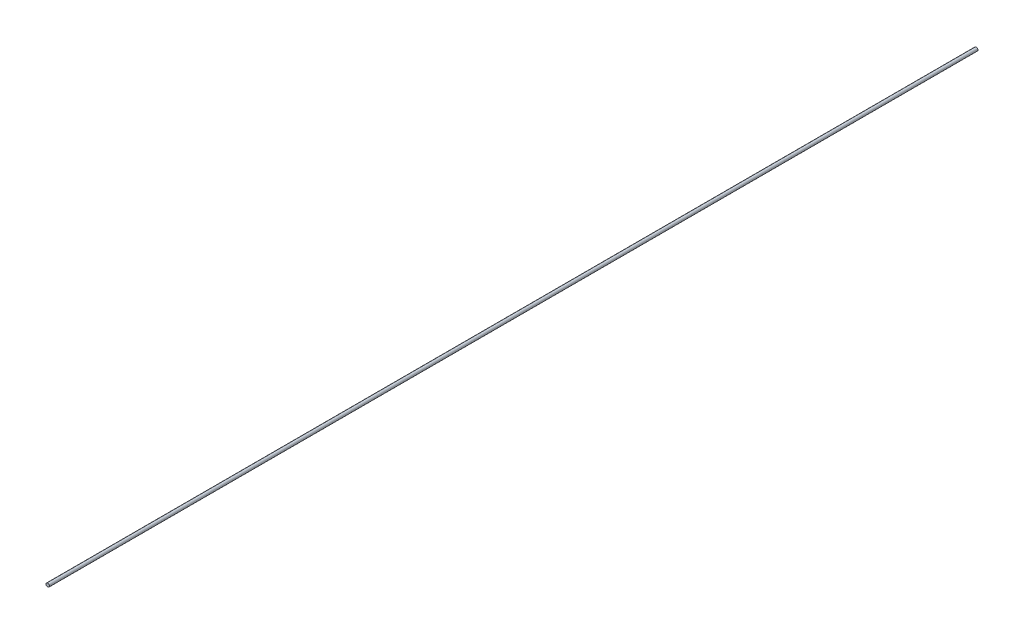
ISO-10303-21;
HEADER;
FILE_DESCRIPTION(('STEP AP214'),'2;1');
FILE_NAME('part.step','',(''),(''),'','','');
FILE_SCHEMA(('AUTOMOTIVE_DESIGN { 1 0 10303 214 1 1 1 1 }'));
ENDSEC;
DATA;
#1=APPLICATION_CONTEXT('core data for automotive mechanical design processes');
#2=APPLICATION_PROTOCOL_DEFINITION('international standard','automotive_design',2000,#1);
#3=PRODUCT_CONTEXT('',#1,'mechanical');
#4=PRODUCT('Part','Part','',(#3));
#5=PRODUCT_RELATED_PRODUCT_CATEGORY('part','',(#4));
#6=PRODUCT_DEFINITION_FORMATION('','',#4);
#7=PRODUCT_DEFINITION_CONTEXT('part definition',#1,'design');
#8=PRODUCT_DEFINITION('design','',#6,#7);
#9=PRODUCT_DEFINITION_SHAPE('','',#8);
#10=(LENGTH_UNIT() NAMED_UNIT(*) SI_UNIT(.MILLI.,.METRE.));
#11=(NAMED_UNIT(*) PLANE_ANGLE_UNIT() SI_UNIT($,.RADIAN.));
#12=(NAMED_UNIT(*) SI_UNIT($,.STERADIAN.) SOLID_ANGLE_UNIT());
#13=UNCERTAINTY_MEASURE_WITH_UNIT(LENGTH_MEASURE(1.E-05),#10,'distance_accuracy_value','');
#14=(GEOMETRIC_REPRESENTATION_CONTEXT(3) GLOBAL_UNCERTAINTY_ASSIGNED_CONTEXT((#13)) GLOBAL_UNIT_ASSIGNED_CONTEXT((#10,
#11,#12)) REPRESENTATION_CONTEXT('',''));
#15=CARTESIAN_POINT('',(0.,0.,0.));
#16=DIRECTION('',(0.,0.,1.));
#17=DIRECTION('',(1.,0.,0.));
#18=AXIS2_PLACEMENT_3D('',#15,#16,#17);
#19=CARTESIAN_POINT('',(0.,0.,2072.));
#20=DIRECTION('',(0.,0.,-1.));
#21=DIRECTION('',(-1.,0.,0.));
#22=AXIS2_PLACEMENT_3D('',#19,#20,#21);
#23=CYLINDRICAL_SURFACE('',#22,3.8);
#24=CARTESIAN_POINT('',(0.,0.,2072.));
#25=DIRECTION('',(0.,0.,1.));
#26=DIRECTION('',(1.,0.,0.));
#27=AXIS2_PLACEMENT_3D('',#24,#25,#26);
#28=CIRCLE('',#27,3.8);
#29=CARTESIAN_POINT('',(3.8,0.,2072.));
#30=VERTEX_POINT('',#29);
#31=EDGE_CURVE('E10',#30,#30,#28,.T.);
#32=ORIENTED_EDGE('',*,*,#31,.F.);
#33=EDGE_LOOP('',(#32));
#34=FACE_BOUND('',#33,.T.);
#35=CARTESIAN_POINT('',(0.,0.,0.));
#36=DIRECTION('',(0.,0.,1.));
#37=DIRECTION('',(1.,0.,0.));
#38=AXIS2_PLACEMENT_3D('',#35,#36,#37);
#39=CIRCLE('',#38,3.8);
#40=CARTESIAN_POINT('',(3.8,0.,0.));
#41=VERTEX_POINT('',#40);
#42=EDGE_CURVE('E40',#41,#41,#39,.T.);
#43=ORIENTED_EDGE('',*,*,#42,.T.);
#44=EDGE_LOOP('',(#43));
#45=FACE_BOUND('',#44,.T.);
#46=ADVANCED_FACE('F37',(#34,#45),#23,.T.);
#47=CARTESIAN_POINT('',(0.,0.,2072.));
#48=DIRECTION('',(0.,0.,1.));
#49=DIRECTION('',(1.,0.,0.));
#50=AXIS2_PLACEMENT_3D('',#47,#48,#49);
#51=PLANE('',#50);
#52=ORIENTED_EDGE('',*,*,#31,.T.);
#53=EDGE_LOOP('',(#52));
#54=FACE_BOUND('',#53,.T.);
#55=ADVANCED_FACE('F54',(#54),#51,.T.);
#56=CARTESIAN_POINT('',(0.,0.,0.));
#57=DIRECTION('',(0.,0.,1.));
#58=DIRECTION('',(1.,0.,0.));
#59=AXIS2_PLACEMENT_3D('',#56,#57,#58);
#60=PLANE('',#59);
#61=ORIENTED_EDGE('',*,*,#42,.F.);
#62=EDGE_LOOP('',(#61));
#63=FACE_BOUND('',#62,.T.);
#64=ADVANCED_FACE('F52',(#63),#60,.F.);
#65=CLOSED_SHELL('',(#46,#55,#64));
#66=MANIFOLD_SOLID_BREP('B2',#65);
#67=ADVANCED_BREP_SHAPE_REPRESENTATION('',(#18,#66),#14);
#68=SHAPE_DEFINITION_REPRESENTATION(#9,#67);
ENDSEC;
END-ISO-10303-21;
